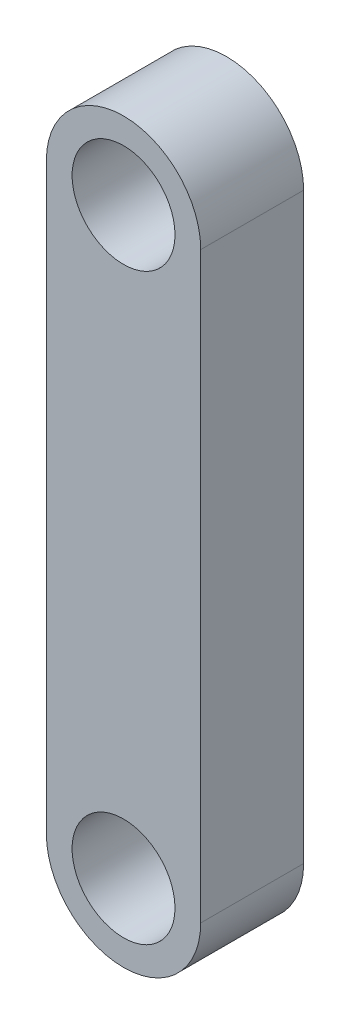
ISO-10303-21;
HEADER;
FILE_DESCRIPTION(('STEP AP214'),'2;1');
FILE_NAME('part.step','',(''),(''),'','','');
FILE_SCHEMA(('AUTOMOTIVE_DESIGN { 1 0 10303 214 1 1 1 1 }'));
ENDSEC;
DATA;
#1=APPLICATION_CONTEXT('core data for automotive mechanical design processes');
#2=APPLICATION_PROTOCOL_DEFINITION('international standard','automotive_design',2000,#1);
#3=PRODUCT_CONTEXT('',#1,'mechanical');
#4=PRODUCT('Part','Part','',(#3));
#5=PRODUCT_RELATED_PRODUCT_CATEGORY('part','',(#4));
#6=PRODUCT_DEFINITION_FORMATION('','',#4);
#7=PRODUCT_DEFINITION_CONTEXT('part definition',#1,'design');
#8=PRODUCT_DEFINITION('design','',#6,#7);
#9=PRODUCT_DEFINITION_SHAPE('','',#8);
#10=(LENGTH_UNIT() NAMED_UNIT(*) SI_UNIT(.MILLI.,.METRE.));
#11=(NAMED_UNIT(*) PLANE_ANGLE_UNIT() SI_UNIT($,.RADIAN.));
#12=(NAMED_UNIT(*) SI_UNIT($,.STERADIAN.) SOLID_ANGLE_UNIT());
#13=UNCERTAINTY_MEASURE_WITH_UNIT(LENGTH_MEASURE(1.E-05),#10,'distance_accuracy_value','');
#14=(GEOMETRIC_REPRESENTATION_CONTEXT(3) GLOBAL_UNCERTAINTY_ASSIGNED_CONTEXT((#13)) GLOBAL_UNIT_ASSIGNED_CONTEXT((#10,
#11,#12)) REPRESENTATION_CONTEXT('',''));
#15=CARTESIAN_POINT('',(0.,0.,0.));
#16=DIRECTION('',(0.,0.,1.));
#17=DIRECTION('',(1.,0.,0.));
#18=AXIS2_PLACEMENT_3D('',#15,#16,#17);
#19=CARTESIAN_POINT('',(69.9999999983334,48.4999714190197,3.));
#20=DIRECTION('',(0.,0.,1.));
#21=DIRECTION('',(1.,0.,0.));
#22=AXIS2_PLACEMENT_3D('',#19,#20,#21);
#23=PLANE('',#22);
#24=CARTESIAN_POINT('',(69.9999999983334,48.4999714190197,3.));
#25=DIRECTION('',(0.,0.,1.));
#26=DIRECTION('',(1.,0.,0.));
#27=AXIS2_PLACEMENT_3D('',#24,#25,#26);
#28=CIRCLE('',#27,1.5000000016666);
#29=CARTESIAN_POINT('',(71.5,48.4999714190197,3.));
#30=VERTEX_POINT('',#29);
#31=EDGE_CURVE('E100',#30,#30,#28,.T.);
#32=ORIENTED_EDGE('',*,*,#31,.F.);
#33=EDGE_LOOP('',(#32));
#34=FACE_BOUND('',#33,.T.);
#35=CARTESIAN_POINT('',(69.9999999983334,48.4999714190197,3.));
#36=DIRECTION('',(0.,0.,1.));
#37=DIRECTION('',(1.,0.,0.));
#38=AXIS2_PLACEMENT_3D('',#35,#36,#37);
#39=CIRCLE('',#38,2.25);
#40=CARTESIAN_POINT('',(72.25,48.4999714206864,3.));
#41=VERTEX_POINT('',#40);
#42=CARTESIAN_POINT('',(67.75,48.4999714206863,3.));
#43=VERTEX_POINT('',#42);
#44=EDGE_CURVE('E85',#41,#43,#39,.T.);
#45=ORIENTED_EDGE('',*,*,#44,.T.);
#46=DIRECTION('',(0.,-1.,0.));
#47=VECTOR('',#46,1.);
#48=CARTESIAN_POINT('',(67.75,48.4999714206863,3.));
#49=LINE('',#48,#47);
#50=CARTESIAN_POINT('',(67.7499999983334,31.4999714206863,3.));
#51=VERTEX_POINT('',#50);
#52=EDGE_CURVE('E80',#43,#51,#49,.T.);
#53=ORIENTED_EDGE('',*,*,#52,.T.);
#54=CARTESIAN_POINT('',(69.9999999983334,31.4999714190197,3.));
#55=DIRECTION('',(0.,0.,1.));
#56=DIRECTION('',(1.,0.,0.));
#57=AXIS2_PLACEMENT_3D('',#54,#55,#56);
#58=CIRCLE('',#57,2.25000000000003);
#59=CARTESIAN_POINT('',(72.25,31.4999714206811,3.));
#60=VERTEX_POINT('',#59);
#61=EDGE_CURVE('E83',#51,#60,#58,.T.);
#62=ORIENTED_EDGE('',*,*,#61,.T.);
#63=DIRECTION('',(0.,1.,0.));
#64=VECTOR('',#63,1.);
#65=CARTESIAN_POINT('',(72.25,48.4999714206864,3.));
#66=LINE('',#65,#64);
#67=EDGE_CURVE('E50',#60,#41,#66,.T.);
#68=ORIENTED_EDGE('',*,*,#67,.T.);
#69=EDGE_LOOP('',(#45,#53,#62,#68));
#70=FACE_BOUND('',#69,.T.);
#71=CARTESIAN_POINT('',(69.9999999983334,31.4999714190197,3.));
#72=DIRECTION('',(0.,0.,1.));
#73=DIRECTION('',(1.,0.,0.));
#74=AXIS2_PLACEMENT_3D('',#71,#72,#73);
#75=CIRCLE('',#74,1.50000000166664);
#76=CARTESIAN_POINT('',(71.5,31.4999714190197,3.));
#77=VERTEX_POINT('',#76);
#78=EDGE_CURVE('E115',#77,#77,#75,.T.);
#79=ORIENTED_EDGE('',*,*,#78,.F.);
#80=EDGE_LOOP('',(#79));
#81=FACE_BOUND('',#80,.T.);
#82=ADVANCED_FACE('F33',(#34,#70,#81),#23,.T.);
#83=CARTESIAN_POINT('',(69.9999999983334,48.4999714190197,0.));
#84=DIRECTION('',(0.,0.,1.));
#85=DIRECTION('',(1.,0.,0.));
#86=AXIS2_PLACEMENT_3D('',#83,#84,#85);
#87=PLANE('',#86);
#88=CARTESIAN_POINT('',(69.9999999983334,48.4999714190197,0.));
#89=DIRECTION('',(0.,0.,1.));
#90=DIRECTION('',(1.,0.,0.));
#91=AXIS2_PLACEMENT_3D('',#88,#89,#90);
#92=CIRCLE('',#91,2.25);
#93=CARTESIAN_POINT('',(72.25,48.4999714206864,0.));
#94=VERTEX_POINT('',#93);
#95=CARTESIAN_POINT('',(67.75,48.4999714206863,0.));
#96=VERTEX_POINT('',#95);
#97=EDGE_CURVE('E97',#94,#96,#92,.T.);
#98=ORIENTED_EDGE('',*,*,#97,.F.);
#99=DIRECTION('',(0.,1.,0.));
#100=VECTOR('',#99,1.);
#101=CARTESIAN_POINT('',(72.25,48.4999714206864,0.));
#102=LINE('',#101,#100);
#103=CARTESIAN_POINT('',(72.25,31.4999714206811,0.));
#104=VERTEX_POINT('',#103);
#105=EDGE_CURVE('E73',#104,#94,#102,.T.);
#106=ORIENTED_EDGE('',*,*,#105,.F.);
#107=CARTESIAN_POINT('',(69.9999999983334,31.4999714190197,0.));
#108=DIRECTION('',(0.,0.,1.));
#109=DIRECTION('',(1.,0.,0.));
#110=AXIS2_PLACEMENT_3D('',#107,#108,#109);
#111=CIRCLE('',#110,2.25000000000003);
#112=CARTESIAN_POINT('',(67.7499999983334,31.4999714206863,0.));
#113=VERTEX_POINT('',#112);
#114=EDGE_CURVE('E67',#113,#104,#111,.T.);
#115=ORIENTED_EDGE('',*,*,#114,.F.);
#116=DIRECTION('',(0.,-1.,0.));
#117=VECTOR('',#116,1.);
#118=CARTESIAN_POINT('',(67.75,48.4999714206863,0.));
#119=LINE('',#118,#117);
#120=EDGE_CURVE('E89',#96,#113,#119,.T.);
#121=ORIENTED_EDGE('',*,*,#120,.F.);
#122=EDGE_LOOP('',(#98,#106,#115,#121));
#123=FACE_BOUND('',#122,.T.);
#124=CARTESIAN_POINT('',(69.9999999983334,48.4999714190197,0.));
#125=DIRECTION('',(0.,0.,1.));
#126=DIRECTION('',(1.,0.,0.));
#127=AXIS2_PLACEMENT_3D('',#124,#125,#126);
#128=CIRCLE('',#127,1.5000000016666);
#129=CARTESIAN_POINT('',(71.5,48.4999714190197,0.));
#130=VERTEX_POINT('',#129);
#131=EDGE_CURVE('E112',#130,#130,#128,.T.);
#132=ORIENTED_EDGE('',*,*,#131,.T.);
#133=EDGE_LOOP('',(#132));
#134=FACE_BOUND('',#133,.T.);
#135=CARTESIAN_POINT('',(69.9999999983334,31.4999714190197,0.));
#136=DIRECTION('',(0.,0.,1.));
#137=DIRECTION('',(1.,0.,0.));
#138=AXIS2_PLACEMENT_3D('',#135,#136,#137);
#139=CIRCLE('',#138,1.50000000166664);
#140=CARTESIAN_POINT('',(71.5,31.4999714190197,0.));
#141=VERTEX_POINT('',#140);
#142=EDGE_CURVE('E118',#141,#141,#139,.T.);
#143=ORIENTED_EDGE('',*,*,#142,.T.);
#144=EDGE_LOOP('',(#143));
#145=FACE_BOUND('',#144,.T.);
#146=ADVANCED_FACE('F108',(#123,#134,#145),#87,.F.);
#147=CARTESIAN_POINT('',(69.9999999983334,48.4999714190197,3.));
#148=DIRECTION('',(0.,0.,-1.));
#149=DIRECTION('',(-1.,0.,0.));
#150=AXIS2_PLACEMENT_3D('',#147,#148,#149);
#151=CYLINDRICAL_SURFACE('',#150,2.25);
#152=ORIENTED_EDGE('',*,*,#97,.T.);
#153=DIRECTION('',(0.,0.,-1.));
#154=VECTOR('',#153,1.);
#155=CARTESIAN_POINT('',(67.75,48.4999714206863,3.));
#156=LINE('',#155,#154);
#157=EDGE_CURVE('E11',#43,#96,#156,.T.);
#158=ORIENTED_EDGE('',*,*,#157,.F.);
#159=ORIENTED_EDGE('',*,*,#44,.F.);
#160=DIRECTION('',(0.,0.,-1.));
#161=VECTOR('',#160,1.);
#162=CARTESIAN_POINT('',(72.25,48.4999714206864,3.));
#163=LINE('',#162,#161);
#164=EDGE_CURVE('E93',#41,#94,#163,.T.);
#165=ORIENTED_EDGE('',*,*,#164,.T.);
#166=EDGE_LOOP('',(#152,#158,#159,#165));
#167=FACE_BOUND('',#166,.T.);
#168=ADVANCED_FACE('F35',(#167),#151,.T.);
#169=CARTESIAN_POINT('',(67.75,48.4999714206863,3.));
#170=DIRECTION('',(1.,0.,0.));
#171=DIRECTION('',(0.,0.,-1.));
#172=AXIS2_PLACEMENT_3D('',#169,#170,#171);
#173=PLANE('',#172);
#174=ORIENTED_EDGE('',*,*,#120,.T.);
#175=DIRECTION('',(0.,0.,-1.));
#176=VECTOR('',#175,1.);
#177=CARTESIAN_POINT('',(67.7499999983334,31.4999714206863,3.));
#178=LINE('',#177,#176);
#179=EDGE_CURVE('E42',#51,#113,#178,.T.);
#180=ORIENTED_EDGE('',*,*,#179,.F.);
#181=ORIENTED_EDGE('',*,*,#52,.F.);
#182=ORIENTED_EDGE('',*,*,#157,.T.);
#183=EDGE_LOOP('',(#174,#180,#181,#182));
#184=FACE_BOUND('',#183,.T.);
#185=ADVANCED_FACE('F88',(#184),#173,.F.);
#186=CARTESIAN_POINT('',(69.9999999983334,31.4999714190197,3.));
#187=DIRECTION('',(0.,0.,-1.));
#188=DIRECTION('',(-1.,0.,0.));
#189=AXIS2_PLACEMENT_3D('',#186,#187,#188);
#190=CYLINDRICAL_SURFACE('',#189,2.25000000000003);
#191=ORIENTED_EDGE('',*,*,#114,.T.);
#192=DIRECTION('',(0.,0.,-1.));
#193=VECTOR('',#192,1.);
#194=CARTESIAN_POINT('',(72.25,31.4999714206811,3.));
#195=LINE('',#194,#193);
#196=EDGE_CURVE('E90',#60,#104,#195,.T.);
#197=ORIENTED_EDGE('',*,*,#196,.F.);
#198=ORIENTED_EDGE('',*,*,#61,.F.);
#199=ORIENTED_EDGE('',*,*,#179,.T.);
#200=EDGE_LOOP('',(#191,#197,#198,#199));
#201=FACE_BOUND('',#200,.T.);
#202=ADVANCED_FACE('F91',(#201),#190,.T.);
#203=CARTESIAN_POINT('',(72.25,48.4999714206864,3.));
#204=DIRECTION('',(-1.,0.,0.));
#205=DIRECTION('',(0.,-1.,0.));
#206=AXIS2_PLACEMENT_3D('',#203,#204,#205);
#207=PLANE('',#206);
#208=ORIENTED_EDGE('',*,*,#105,.T.);
#209=ORIENTED_EDGE('',*,*,#164,.F.);
#210=ORIENTED_EDGE('',*,*,#67,.F.);
#211=ORIENTED_EDGE('',*,*,#196,.T.);
#212=EDGE_LOOP('',(#208,#209,#210,#211));
#213=FACE_BOUND('',#212,.T.);
#214=ADVANCED_FACE('F105',(#213),#207,.F.);
#215=CARTESIAN_POINT('',(69.9999999983334,48.4999714190197,3.));
#216=DIRECTION('',(0.,0.,-1.));
#217=DIRECTION('',(-1.,0.,0.));
#218=AXIS2_PLACEMENT_3D('',#215,#216,#217);
#219=CYLINDRICAL_SURFACE('',#218,1.5000000016666);
#220=ORIENTED_EDGE('',*,*,#31,.T.);
#221=EDGE_LOOP('',(#220));
#222=FACE_BOUND('',#221,.T.);
#223=ORIENTED_EDGE('',*,*,#131,.F.);
#224=EDGE_LOOP('',(#223));
#225=FACE_BOUND('',#224,.T.);
#226=ADVANCED_FACE('F135',(#222,#225),#219,.F.);
#227=CARTESIAN_POINT('',(69.9999999983334,31.4999714190197,3.));
#228=DIRECTION('',(0.,0.,-1.));
#229=DIRECTION('',(-1.,0.,0.));
#230=AXIS2_PLACEMENT_3D('',#227,#228,#229);
#231=CYLINDRICAL_SURFACE('',#230,1.50000000166664);
#232=ORIENTED_EDGE('',*,*,#78,.T.);
#233=EDGE_LOOP('',(#232));
#234=FACE_BOUND('',#233,.T.);
#235=ORIENTED_EDGE('',*,*,#142,.F.);
#236=EDGE_LOOP('',(#235));
#237=FACE_BOUND('',#236,.T.);
#238=ADVANCED_FACE('F124',(#234,#237),#231,.F.);
#239=CLOSED_SHELL('',(#82,#146,#168,#185,#202,#214,#226,#238));
#240=MANIFOLD_SOLID_BREP('B2',#239);
#241=ADVANCED_BREP_SHAPE_REPRESENTATION('',(#18,#240),#14);
#242=SHAPE_DEFINITION_REPRESENTATION(#9,#241);
ENDSEC;
END-ISO-10303-21;
